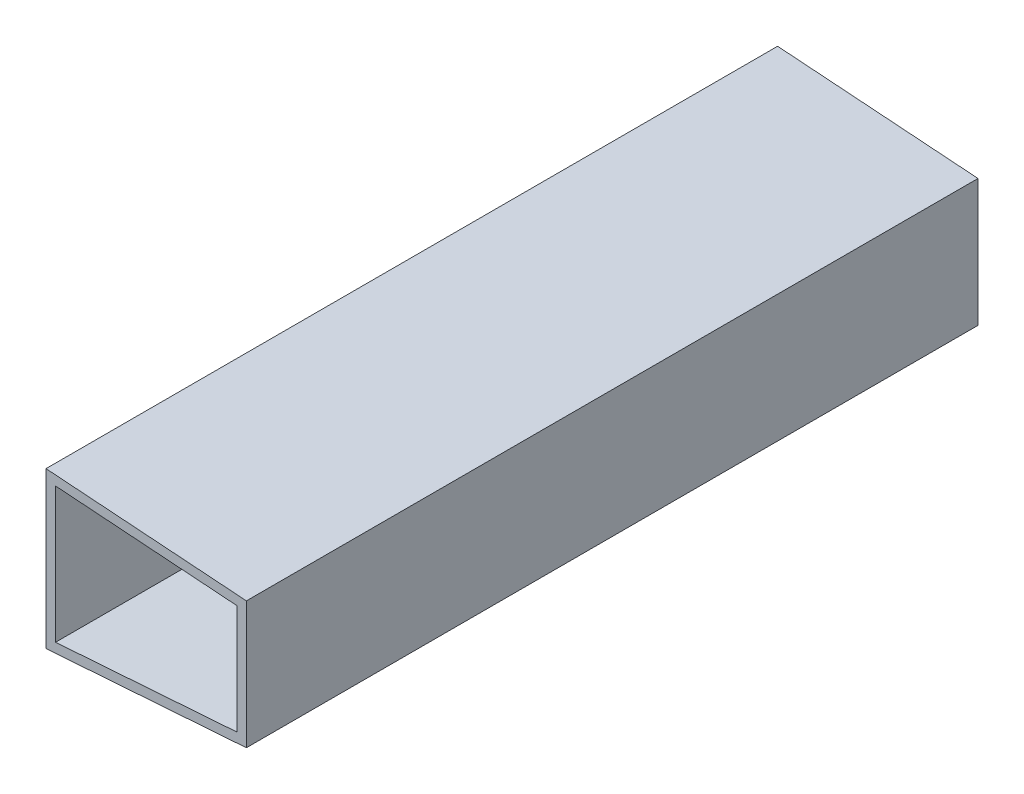
ISO-10303-21;
HEADER;
FILE_DESCRIPTION(('STEP AP214'),'2;1');
FILE_NAME('part.step','',(''),(''),'','','');
FILE_SCHEMA(('AUTOMOTIVE_DESIGN { 1 0 10303 214 1 1 1 1 }'));
ENDSEC;
DATA;
#1=APPLICATION_CONTEXT('core data for automotive mechanical design processes');
#2=APPLICATION_PROTOCOL_DEFINITION('international standard','automotive_design',2000,#1);
#3=PRODUCT_CONTEXT('',#1,'mechanical');
#4=PRODUCT('Part','Part','',(#3));
#5=PRODUCT_RELATED_PRODUCT_CATEGORY('part','',(#4));
#6=PRODUCT_DEFINITION_FORMATION('','',#4);
#7=PRODUCT_DEFINITION_CONTEXT('part definition',#1,'design');
#8=PRODUCT_DEFINITION('design','',#6,#7);
#9=PRODUCT_DEFINITION_SHAPE('','',#8);
#10=(LENGTH_UNIT() NAMED_UNIT(*) SI_UNIT(.MILLI.,.METRE.));
#11=(NAMED_UNIT(*) PLANE_ANGLE_UNIT() SI_UNIT($,.RADIAN.));
#12=(NAMED_UNIT(*) SI_UNIT($,.STERADIAN.) SOLID_ANGLE_UNIT());
#13=UNCERTAINTY_MEASURE_WITH_UNIT(LENGTH_MEASURE(1.E-05),#10,'distance_accuracy_value','');
#14=(GEOMETRIC_REPRESENTATION_CONTEXT(3) GLOBAL_UNCERTAINTY_ASSIGNED_CONTEXT((#13)) GLOBAL_UNIT_ASSIGNED_CONTEXT((#10,
#11,#12)) REPRESENTATION_CONTEXT('',''));
#15=CARTESIAN_POINT('',(0.,0.,0.));
#16=DIRECTION('',(0.,0.,1.));
#17=DIRECTION('',(1.,0.,0.));
#18=AXIS2_PLACEMENT_3D('',#15,#16,#17);
#19=CARTESIAN_POINT('',(0.,0.,230.));
#20=DIRECTION('',(0.,0.,1.));
#21=DIRECTION('',(1.,0.,0.));
#22=AXIS2_PLACEMENT_3D('',#19,#20,#21);
#23=PLANE('',#22);
#24=DIRECTION('',(-0.997458699830735,0.0712470499879096,0.));
#25=VECTOR('',#24,1.);
#26=CARTESIAN_POINT('',(0.,24.5,230.));
#27=LINE('',#26,#25);
#28=CARTESIAN_POINT('',(63.,20.,230.));
#29=VERTEX_POINT('',#28);
#30=CARTESIAN_POINT('',(0.,24.5,230.));
#31=VERTEX_POINT('',#30);
#32=EDGE_CURVE('E177',#29,#31,#27,.T.);
#33=ORIENTED_EDGE('',*,*,#32,.T.);
#34=DIRECTION('',(0.,-1.,0.));
#35=VECTOR('',#34,1.);
#36=CARTESIAN_POINT('',(0.,-24.5,230.));
#37=LINE('',#36,#35);
#38=CARTESIAN_POINT('',(0.,-24.5,230.));
#39=VERTEX_POINT('',#38);
#40=EDGE_CURVE('E181',#31,#39,#37,.T.);
#41=ORIENTED_EDGE('',*,*,#40,.T.);
#42=DIRECTION('',(0.997458699830735,0.0712470499879096,0.));
#43=VECTOR('',#42,1.);
#44=CARTESIAN_POINT('',(63.,-20.,230.));
#45=LINE('',#44,#43);
#46=CARTESIAN_POINT('',(63.,-20.,230.));
#47=VERTEX_POINT('',#46);
#48=EDGE_CURVE('E185',#39,#47,#45,.T.);
#49=ORIENTED_EDGE('',*,*,#48,.T.);
#50=DIRECTION('',(0.,1.,0.));
#51=VECTOR('',#50,1.);
#52=CARTESIAN_POINT('',(63.,20.,230.));
#53=LINE('',#52,#51);
#54=EDGE_CURVE('E188',#47,#29,#53,.T.);
#55=ORIENTED_EDGE('',*,*,#54,.T.);
#56=EDGE_LOOP('',(#33,#41,#49,#55));
#57=FACE_BOUND('',#56,.T.);
#58=DIRECTION('',(0.,-1.,0.));
#59=VECTOR('',#58,1.);
#60=CARTESIAN_POINT('',(3.,0.,230.));
#61=LINE('',#60,#59);
#62=CARTESIAN_POINT('',(2.99999999999999,21.2780709612247,230.));
#63=VERTEX_POINT('',#62);
#64=CARTESIAN_POINT('',(3.,-21.2780709612247,230.));
#65=VERTEX_POINT('',#64);
#66=EDGE_CURVE('E138',#63,#65,#61,.T.);
#67=ORIENTED_EDGE('',*,*,#66,.F.);
#68=DIRECTION('',(-0.997458699830735,0.0712470499879096,0.));
#69=VECTOR('',#68,1.);
#70=CARTESIAN_POINT('',(1.52737560130531,21.3832584182743,230.));
#71=LINE('',#70,#69);
#72=CARTESIAN_POINT('',(60.,17.2066423897961,230.));
#73=VERTEX_POINT('',#72);
#74=EDGE_CURVE('E129',#73,#63,#71,.T.);
#75=ORIENTED_EDGE('',*,*,#74,.F.);
#76=DIRECTION('',(0.,1.,0.));
#77=VECTOR('',#76,1.);
#78=CARTESIAN_POINT('',(60.,0.,230.));
#79=LINE('',#78,#77);
#80=CARTESIAN_POINT('',(60.,-17.2066423897961,230.));
#81=VERTEX_POINT('',#80);
#82=EDGE_CURVE('E155',#81,#73,#79,.T.);
#83=ORIENTED_EDGE('',*,*,#82,.F.);
#84=DIRECTION('',(0.997458699830735,0.0712470499879097,0.));
#85=VECTOR('',#84,1.);
#86=CARTESIAN_POINT('',(1.52737560130531,-21.3832584182743,230.));
#87=LINE('',#86,#85);
#88=EDGE_CURVE('E151',#65,#81,#87,.T.);
#89=ORIENTED_EDGE('',*,*,#88,.F.);
#90=EDGE_LOOP('',(#67,#75,#83,#89));
#91=FACE_BOUND('',#90,.T.);
#92=ADVANCED_FACE('F63',(#57,#91),#23,.T.);
#93=CARTESIAN_POINT('',(0.,0.,0.));
#94=DIRECTION('',(0.,0.,1.));
#95=DIRECTION('',(1.,0.,0.));
#96=AXIS2_PLACEMENT_3D('',#93,#94,#95);
#97=PLANE('',#96);
#98=DIRECTION('',(-0.997458699830735,0.0712470499879096,0.));
#99=VECTOR('',#98,1.);
#100=CARTESIAN_POINT('',(0.,24.5,0.));
#101=LINE('',#100,#99);
#102=CARTESIAN_POINT('',(63.,20.,0.));
#103=VERTEX_POINT('',#102);
#104=CARTESIAN_POINT('',(0.,24.5,0.));
#105=VERTEX_POINT('',#104);
#106=EDGE_CURVE('E147',#103,#105,#101,.T.);
#107=ORIENTED_EDGE('',*,*,#106,.F.);
#108=DIRECTION('',(0.,1.,0.));
#109=VECTOR('',#108,1.);
#110=CARTESIAN_POINT('',(63.,20.,0.));
#111=LINE('',#110,#109);
#112=CARTESIAN_POINT('',(63.,-20.,0.));
#113=VERTEX_POINT('',#112);
#114=EDGE_CURVE('E182',#113,#103,#111,.T.);
#115=ORIENTED_EDGE('',*,*,#114,.F.);
#116=DIRECTION('',(0.997458699830735,0.0712470499879096,0.));
#117=VECTOR('',#116,1.);
#118=CARTESIAN_POINT('',(63.,-20.,0.));
#119=LINE('',#118,#117);
#120=CARTESIAN_POINT('',(0.,-24.5,0.));
#121=VERTEX_POINT('',#120);
#122=EDGE_CURVE('E198',#121,#113,#119,.T.);
#123=ORIENTED_EDGE('',*,*,#122,.F.);
#124=DIRECTION('',(0.,-1.,0.));
#125=VECTOR('',#124,1.);
#126=CARTESIAN_POINT('',(0.,-24.5,0.));
#127=LINE('',#126,#125);
#128=EDGE_CURVE('E195',#105,#121,#127,.T.);
#129=ORIENTED_EDGE('',*,*,#128,.F.);
#130=EDGE_LOOP('',(#107,#115,#123,#129));
#131=FACE_BOUND('',#130,.T.);
#132=DIRECTION('',(-0.997458699830735,0.0712470499879096,0.));
#133=VECTOR('',#132,1.);
#134=CARTESIAN_POINT('',(1.52737560130531,21.3832584182743,0.));
#135=LINE('',#134,#133);
#136=CARTESIAN_POINT('',(60.,17.2066423897961,0.));
#137=VERTEX_POINT('',#136);
#138=CARTESIAN_POINT('',(2.99999999999999,21.2780709612247,0.));
#139=VERTEX_POINT('',#138);
#140=EDGE_CURVE('E87',#137,#139,#135,.T.);
#141=ORIENTED_EDGE('',*,*,#140,.T.);
#142=DIRECTION('',(0.,-1.,0.));
#143=VECTOR('',#142,1.);
#144=CARTESIAN_POINT('',(3.,0.,0.));
#145=LINE('',#144,#143);
#146=CARTESIAN_POINT('',(3.,-21.2780709612247,0.));
#147=VERTEX_POINT('',#146);
#148=EDGE_CURVE('E145',#139,#147,#145,.T.);
#149=ORIENTED_EDGE('',*,*,#148,.T.);
#150=DIRECTION('',(0.997458699830735,0.0712470499879097,0.));
#151=VECTOR('',#150,1.);
#152=CARTESIAN_POINT('',(1.52737560130531,-21.3832584182743,0.));
#153=LINE('',#152,#151);
#154=CARTESIAN_POINT('',(60.,-17.2066423897961,0.));
#155=VERTEX_POINT('',#154);
#156=EDGE_CURVE('E164',#147,#155,#153,.T.);
#157=ORIENTED_EDGE('',*,*,#156,.T.);
#158=DIRECTION('',(0.,1.,0.));
#159=VECTOR('',#158,1.);
#160=CARTESIAN_POINT('',(60.,0.,0.));
#161=LINE('',#160,#159);
#162=EDGE_CURVE('E139',#155,#137,#161,.T.);
#163=ORIENTED_EDGE('',*,*,#162,.T.);
#164=EDGE_LOOP('',(#141,#149,#157,#163));
#165=FACE_BOUND('',#164,.T.);
#166=ADVANCED_FACE('F221',(#131,#165),#97,.F.);
#167=CARTESIAN_POINT('',(0.,24.5,230.));
#168=DIRECTION('',(-0.0712470499879096,-0.997458699830735,0.));
#169=DIRECTION('',(0.997458699830735,-0.0712470499879096,0.));
#170=AXIS2_PLACEMENT_3D('',#167,#168,#169);
#171=PLANE('',#170);
#172=ORIENTED_EDGE('',*,*,#106,.T.);
#173=DIRECTION('',(0.,0.,-1.));
#174=VECTOR('',#173,1.);
#175=CARTESIAN_POINT('',(0.,24.5,230.));
#176=LINE('',#175,#174);
#177=EDGE_CURVE('E12',#31,#105,#176,.T.);
#178=ORIENTED_EDGE('',*,*,#177,.F.);
#179=ORIENTED_EDGE('',*,*,#32,.F.);
#180=DIRECTION('',(0.,0.,-1.));
#181=VECTOR('',#180,1.);
#182=CARTESIAN_POINT('',(63.,20.,230.));
#183=LINE('',#182,#181);
#184=EDGE_CURVE('E191',#29,#103,#183,.T.);
#185=ORIENTED_EDGE('',*,*,#184,.T.);
#186=EDGE_LOOP('',(#172,#178,#179,#185));
#187=FACE_BOUND('',#186,.T.);
#188=ADVANCED_FACE('F65',(#187),#171,.F.);
#189=CARTESIAN_POINT('',(0.,-24.5,230.));
#190=DIRECTION('',(1.,0.,0.));
#191=DIRECTION('',(0.,1.,0.));
#192=AXIS2_PLACEMENT_3D('',#189,#190,#191);
#193=PLANE('',#192);
#194=ORIENTED_EDGE('',*,*,#128,.T.);
#195=DIRECTION('',(0.,0.,-1.));
#196=VECTOR('',#195,1.);
#197=CARTESIAN_POINT('',(0.,-24.5,230.));
#198=LINE('',#197,#196);
#199=EDGE_CURVE('E72',#39,#121,#198,.T.);
#200=ORIENTED_EDGE('',*,*,#199,.F.);
#201=ORIENTED_EDGE('',*,*,#40,.F.);
#202=ORIENTED_EDGE('',*,*,#177,.T.);
#203=EDGE_LOOP('',(#194,#200,#201,#202));
#204=FACE_BOUND('',#203,.T.);
#205=ADVANCED_FACE('F231',(#204),#193,.F.);
#206=CARTESIAN_POINT('',(63.,-20.,230.));
#207=DIRECTION('',(-0.0712470499879096,0.997458699830735,0.));
#208=DIRECTION('',(-0.997458699830735,-0.0712470499879097,0.));
#209=AXIS2_PLACEMENT_3D('',#206,#207,#208);
#210=PLANE('',#209);
#211=ORIENTED_EDGE('',*,*,#122,.T.);
#212=DIRECTION('',(0.,0.,-1.));
#213=VECTOR('',#212,1.);
#214=CARTESIAN_POINT('',(63.,-20.,230.));
#215=LINE('',#214,#213);
#216=EDGE_CURVE('E206',#47,#113,#215,.T.);
#217=ORIENTED_EDGE('',*,*,#216,.F.);
#218=ORIENTED_EDGE('',*,*,#48,.F.);
#219=ORIENTED_EDGE('',*,*,#199,.T.);
#220=EDGE_LOOP('',(#211,#217,#218,#219));
#221=FACE_BOUND('',#220,.T.);
#222=ADVANCED_FACE('F215',(#221),#210,.F.);
#223=CARTESIAN_POINT('',(63.,20.,230.));
#224=DIRECTION('',(-1.,0.,0.));
#225=DIRECTION('',(0.,0.,1.));
#226=AXIS2_PLACEMENT_3D('',#223,#224,#225);
#227=PLANE('',#226);
#228=ORIENTED_EDGE('',*,*,#114,.T.);
#229=ORIENTED_EDGE('',*,*,#184,.F.);
#230=ORIENTED_EDGE('',*,*,#54,.F.);
#231=ORIENTED_EDGE('',*,*,#216,.T.);
#232=EDGE_LOOP('',(#228,#229,#230,#231));
#233=FACE_BOUND('',#232,.T.);
#234=ADVANCED_FACE('F225',(#233),#227,.F.);
#235=CARTESIAN_POINT('',(1.52737560130531,21.3832584182743,230.));
#236=DIRECTION('',(-0.0712470499879096,-0.997458699830735,0.));
#237=DIRECTION('',(0.997458699830735,-0.0712470499879096,0.));
#238=AXIS2_PLACEMENT_3D('',#235,#236,#237);
#239=PLANE('',#238);
#240=ORIENTED_EDGE('',*,*,#140,.F.);
#241=DIRECTION('',(0.,0.,-1.));
#242=VECTOR('',#241,1.);
#243=CARTESIAN_POINT('',(60.,17.2066423897961,230.));
#244=LINE('',#243,#242);
#245=EDGE_CURVE('E133',#73,#137,#244,.T.);
#246=ORIENTED_EDGE('',*,*,#245,.F.);
#247=ORIENTED_EDGE('',*,*,#74,.T.);
#248=DIRECTION('',(0.,0.,-1.));
#249=VECTOR('',#248,1.);
#250=CARTESIAN_POINT('',(2.99999999999999,21.2780709612247,230.));
#251=LINE('',#250,#249);
#252=EDGE_CURVE('E132',#63,#139,#251,.T.);
#253=ORIENTED_EDGE('',*,*,#252,.T.);
#254=EDGE_LOOP('',(#240,#246,#247,#253));
#255=FACE_BOUND('',#254,.T.);
#256=ADVANCED_FACE('F131',(#255),#239,.T.);
#257=CARTESIAN_POINT('',(3.,0.,230.));
#258=DIRECTION('',(1.,0.,0.));
#259=DIRECTION('',(0.,1.,0.));
#260=AXIS2_PLACEMENT_3D('',#257,#258,#259);
#261=PLANE('',#260);
#262=ORIENTED_EDGE('',*,*,#148,.F.);
#263=ORIENTED_EDGE('',*,*,#252,.F.);
#264=ORIENTED_EDGE('',*,*,#66,.T.);
#265=DIRECTION('',(0.,0.,-1.));
#266=VECTOR('',#265,1.);
#267=CARTESIAN_POINT('',(3.,-21.2780709612247,230.));
#268=LINE('',#267,#266);
#269=EDGE_CURVE('E148',#65,#147,#268,.T.);
#270=ORIENTED_EDGE('',*,*,#269,.T.);
#271=EDGE_LOOP('',(#262,#263,#264,#270));
#272=FACE_BOUND('',#271,.T.);
#273=ADVANCED_FACE('F142',(#272),#261,.T.);
#274=CARTESIAN_POINT('',(1.52737560130531,-21.3832584182743,230.));
#275=DIRECTION('',(-0.0712470499879096,0.997458699830735,0.));
#276=DIRECTION('',(-0.997458699830735,-0.0712470499879097,0.));
#277=AXIS2_PLACEMENT_3D('',#274,#275,#276);
#278=PLANE('',#277);
#279=ORIENTED_EDGE('',*,*,#156,.F.);
#280=ORIENTED_EDGE('',*,*,#269,.F.);
#281=ORIENTED_EDGE('',*,*,#88,.T.);
#282=DIRECTION('',(0.,0.,-1.));
#283=VECTOR('',#282,1.);
#284=CARTESIAN_POINT('',(60.,-17.2066423897961,230.));
#285=LINE('',#284,#283);
#286=EDGE_CURVE('E79',#81,#155,#285,.T.);
#287=ORIENTED_EDGE('',*,*,#286,.T.);
#288=EDGE_LOOP('',(#279,#280,#281,#287));
#289=FACE_BOUND('',#288,.T.);
#290=ADVANCED_FACE('F254',(#289),#278,.T.);
#291=CARTESIAN_POINT('',(60.,0.,230.));
#292=DIRECTION('',(-1.,0.,0.));
#293=DIRECTION('',(0.,0.,1.));
#294=AXIS2_PLACEMENT_3D('',#291,#292,#293);
#295=PLANE('',#294);
#296=ORIENTED_EDGE('',*,*,#162,.F.);
#297=ORIENTED_EDGE('',*,*,#286,.F.);
#298=ORIENTED_EDGE('',*,*,#82,.T.);
#299=ORIENTED_EDGE('',*,*,#245,.T.);
#300=EDGE_LOOP('',(#296,#297,#298,#299));
#301=FACE_BOUND('',#300,.T.);
#302=ADVANCED_FACE('F258',(#301),#295,.T.);
#303=CLOSED_SHELL('',(#92,#166,#188,#205,#222,#234,#256,#273,#290,#302));
#304=MANIFOLD_SOLID_BREP('B2',#303);
#305=ADVANCED_BREP_SHAPE_REPRESENTATION('',(#18,#304),#14);
#306=SHAPE_DEFINITION_REPRESENTATION(#9,#305);
ENDSEC;
END-ISO-10303-21;
